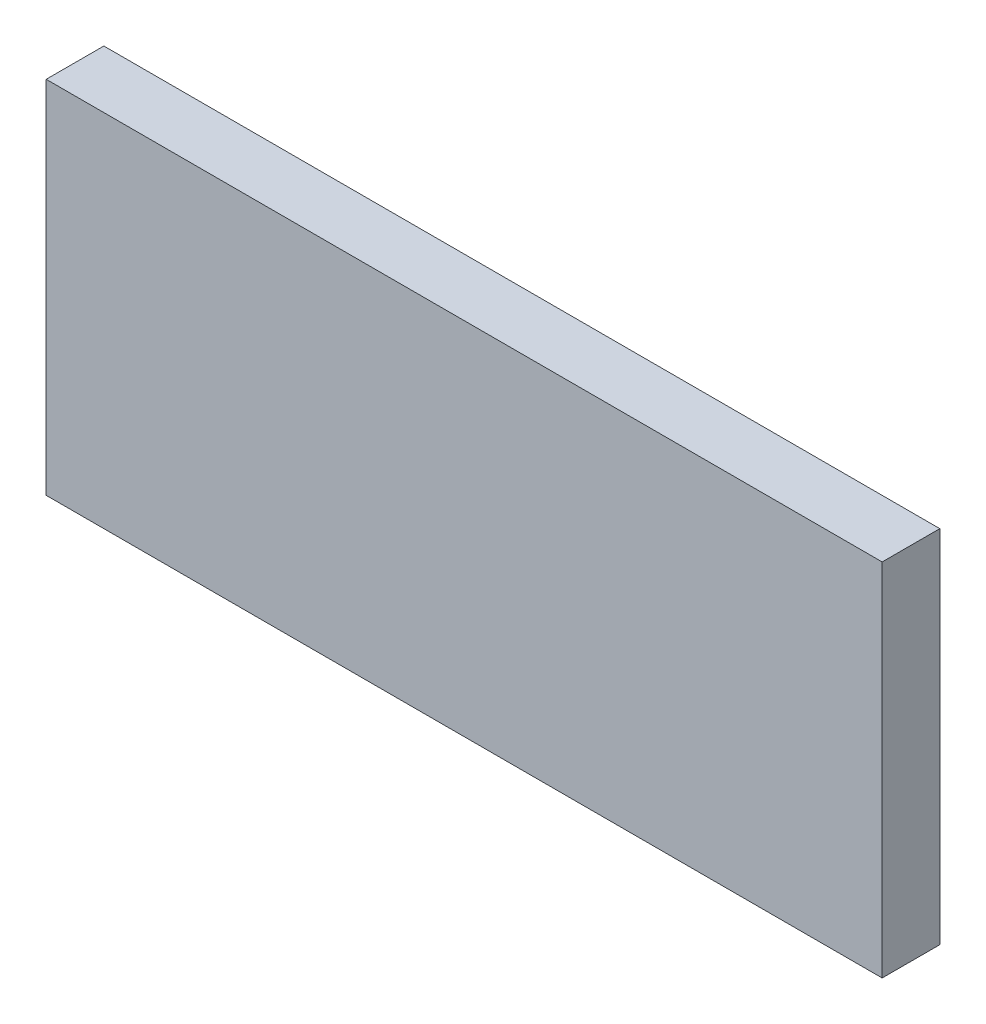
ISO-10303-21;
HEADER;
FILE_DESCRIPTION(('STEP AP214'),'2;1');
FILE_NAME('part.step','',(''),(''),'','','');
FILE_SCHEMA(('AUTOMOTIVE_DESIGN { 1 0 10303 214 1 1 1 1 }'));
ENDSEC;
DATA;
#1=APPLICATION_CONTEXT('core data for automotive mechanical design processes');
#2=APPLICATION_PROTOCOL_DEFINITION('international standard','automotive_design',2000,#1);
#3=PRODUCT_CONTEXT('',#1,'mechanical');
#4=PRODUCT('Part','Part','',(#3));
#5=PRODUCT_RELATED_PRODUCT_CATEGORY('part','',(#4));
#6=PRODUCT_DEFINITION_FORMATION('','',#4);
#7=PRODUCT_DEFINITION_CONTEXT('part definition',#1,'design');
#8=PRODUCT_DEFINITION('design','',#6,#7);
#9=PRODUCT_DEFINITION_SHAPE('','',#8);
#10=(LENGTH_UNIT() NAMED_UNIT(*) SI_UNIT(.MILLI.,.METRE.));
#11=(NAMED_UNIT(*) PLANE_ANGLE_UNIT() SI_UNIT($,.RADIAN.));
#12=(NAMED_UNIT(*) SI_UNIT($,.STERADIAN.) SOLID_ANGLE_UNIT());
#13=UNCERTAINTY_MEASURE_WITH_UNIT(LENGTH_MEASURE(1.E-05),#10,'distance_accuracy_value','');
#14=(GEOMETRIC_REPRESENTATION_CONTEXT(3) GLOBAL_UNCERTAINTY_ASSIGNED_CONTEXT((#13)) GLOBAL_UNIT_ASSIGNED_CONTEXT((#10,
#11,#12)) REPRESENTATION_CONTEXT('',''));
#15=CARTESIAN_POINT('',(0.,0.,0.));
#16=DIRECTION('',(0.,0.,1.));
#17=DIRECTION('',(1.,0.,0.));
#18=AXIS2_PLACEMENT_3D('',#15,#16,#17);
#19=CARTESIAN_POINT('',(-29.,-12.5,4.));
#20=DIRECTION('',(1.,0.,0.));
#21=DIRECTION('',(0.,0.,-1.));
#22=AXIS2_PLACEMENT_3D('',#19,#20,#21);
#23=PLANE('',#22);
#24=DIRECTION('',(0.,-1.,0.));
#25=VECTOR('',#24,1.);
#26=CARTESIAN_POINT('',(-29.,-12.5,0.));
#27=LINE('',#26,#25);
#28=CARTESIAN_POINT('',(-29.,12.5,0.));
#29=VERTEX_POINT('',#28);
#30=CARTESIAN_POINT('',(-29.,-12.5,0.));
#31=VERTEX_POINT('',#30);
#32=EDGE_CURVE('E107',#29,#31,#27,.T.);
#33=ORIENTED_EDGE('',*,*,#32,.T.);
#34=DIRECTION('',(0.,0.,-1.));
#35=VECTOR('',#34,1.);
#36=CARTESIAN_POINT('',(-29.,-12.5,4.));
#37=LINE('',#36,#35);
#38=CARTESIAN_POINT('',(-29.,-12.5,4.));
#39=VERTEX_POINT('',#38);
#40=EDGE_CURVE('E11',#39,#31,#37,.T.);
#41=ORIENTED_EDGE('',*,*,#40,.F.);
#42=DIRECTION('',(0.,-1.,0.));
#43=VECTOR('',#42,1.);
#44=CARTESIAN_POINT('',(-29.,-12.5,4.));
#45=LINE('',#44,#43);
#46=CARTESIAN_POINT('',(-29.,12.5,4.));
#47=VERTEX_POINT('',#46);
#48=EDGE_CURVE('E91',#47,#39,#45,.T.);
#49=ORIENTED_EDGE('',*,*,#48,.F.);
#50=DIRECTION('',(0.,0.,-1.));
#51=VECTOR('',#50,1.);
#52=CARTESIAN_POINT('',(-29.,12.5,4.));
#53=LINE('',#52,#51);
#54=EDGE_CURVE('E103',#47,#29,#53,.T.);
#55=ORIENTED_EDGE('',*,*,#54,.T.);
#56=EDGE_LOOP('',(#33,#41,#49,#55));
#57=FACE_BOUND('',#56,.T.);
#58=ADVANCED_FACE('F39',(#57),#23,.F.);
#59=CARTESIAN_POINT('',(29.,-12.5,4.));
#60=DIRECTION('',(0.,1.,0.));
#61=DIRECTION('',(-1.,0.,0.));
#62=AXIS2_PLACEMENT_3D('',#59,#60,#61);
#63=PLANE('',#62);
#64=DIRECTION('',(1.,0.,0.));
#65=VECTOR('',#64,1.);
#66=CARTESIAN_POINT('',(29.,-12.5,0.));
#67=LINE('',#66,#65);
#68=CARTESIAN_POINT('',(29.,-12.5,0.));
#69=VERTEX_POINT('',#68);
#70=EDGE_CURVE('E96',#31,#69,#67,.T.);
#71=ORIENTED_EDGE('',*,*,#70,.T.);
#72=DIRECTION('',(0.,0.,-1.));
#73=VECTOR('',#72,1.);
#74=CARTESIAN_POINT('',(29.,-12.5,4.));
#75=LINE('',#74,#73);
#76=CARTESIAN_POINT('',(29.,-12.5,4.));
#77=VERTEX_POINT('',#76);
#78=EDGE_CURVE('E48',#77,#69,#75,.T.);
#79=ORIENTED_EDGE('',*,*,#78,.F.);
#80=DIRECTION('',(1.,0.,0.));
#81=VECTOR('',#80,1.);
#82=CARTESIAN_POINT('',(29.,-12.5,4.));
#83=LINE('',#82,#81);
#84=EDGE_CURVE('E86',#39,#77,#83,.T.);
#85=ORIENTED_EDGE('',*,*,#84,.F.);
#86=ORIENTED_EDGE('',*,*,#40,.T.);
#87=EDGE_LOOP('',(#71,#79,#85,#86));
#88=FACE_BOUND('',#87,.T.);
#89=ADVANCED_FACE('F95',(#88),#63,.F.);
#90=CARTESIAN_POINT('',(29.,-12.5,4.));
#91=DIRECTION('',(-1.,0.,0.));
#92=DIRECTION('',(0.,0.,1.));
#93=AXIS2_PLACEMENT_3D('',#90,#91,#92);
#94=PLANE('',#93);
#95=DIRECTION('',(0.,1.,0.));
#96=VECTOR('',#95,1.);
#97=CARTESIAN_POINT('',(29.,-12.5,0.));
#98=LINE('',#97,#96);
#99=CARTESIAN_POINT('',(29.,12.5,0.));
#100=VERTEX_POINT('',#99);
#101=EDGE_CURVE('E73',#69,#100,#98,.T.);
#102=ORIENTED_EDGE('',*,*,#101,.T.);
#103=DIRECTION('',(0.,0.,-1.));
#104=VECTOR('',#103,1.);
#105=CARTESIAN_POINT('',(29.,12.5,4.));
#106=LINE('',#105,#104);
#107=CARTESIAN_POINT('',(29.,12.5,4.));
#108=VERTEX_POINT('',#107);
#109=EDGE_CURVE('E98',#108,#100,#106,.T.);
#110=ORIENTED_EDGE('',*,*,#109,.F.);
#111=DIRECTION('',(0.,1.,0.));
#112=VECTOR('',#111,1.);
#113=CARTESIAN_POINT('',(29.,-12.5,4.));
#114=LINE('',#113,#112);
#115=EDGE_CURVE('E89',#77,#108,#114,.T.);
#116=ORIENTED_EDGE('',*,*,#115,.F.);
#117=ORIENTED_EDGE('',*,*,#78,.T.);
#118=EDGE_LOOP('',(#102,#110,#116,#117));
#119=FACE_BOUND('',#118,.T.);
#120=ADVANCED_FACE('F99',(#119),#94,.F.);
#121=CARTESIAN_POINT('',(29.,12.5,4.));
#122=DIRECTION('',(0.,-1.,0.));
#123=DIRECTION('',(1.,0.,0.));
#124=AXIS2_PLACEMENT_3D('',#121,#122,#123);
#125=PLANE('',#124);
#126=DIRECTION('',(-1.,0.,0.));
#127=VECTOR('',#126,1.);
#128=CARTESIAN_POINT('',(29.,12.5,0.));
#129=LINE('',#128,#127);
#130=EDGE_CURVE('E79',#100,#29,#129,.T.);
#131=ORIENTED_EDGE('',*,*,#130,.T.);
#132=ORIENTED_EDGE('',*,*,#54,.F.);
#133=DIRECTION('',(-1.,0.,0.));
#134=VECTOR('',#133,1.);
#135=CARTESIAN_POINT('',(29.,12.5,4.));
#136=LINE('',#135,#134);
#137=EDGE_CURVE('E56',#108,#47,#136,.T.);
#138=ORIENTED_EDGE('',*,*,#137,.F.);
#139=ORIENTED_EDGE('',*,*,#109,.T.);
#140=EDGE_LOOP('',(#131,#132,#138,#139));
#141=FACE_BOUND('',#140,.T.);
#142=ADVANCED_FACE('F120',(#141),#125,.F.);
#143=CARTESIAN_POINT('',(0.,0.,4.));
#144=DIRECTION('',(0.,0.,1.));
#145=DIRECTION('',(1.,0.,0.));
#146=AXIS2_PLACEMENT_3D('',#143,#144,#145);
#147=PLANE('',#146);
#148=ORIENTED_EDGE('',*,*,#48,.T.);
#149=ORIENTED_EDGE('',*,*,#84,.T.);
#150=ORIENTED_EDGE('',*,*,#115,.T.);
#151=ORIENTED_EDGE('',*,*,#137,.T.);
#152=EDGE_LOOP('',(#148,#149,#150,#151));
#153=FACE_BOUND('',#152,.T.);
#154=ADVANCED_FACE('F87',(#153),#147,.T.);
#155=CARTESIAN_POINT('',(0.,0.,0.));
#156=DIRECTION('',(0.,0.,1.));
#157=DIRECTION('',(1.,0.,0.));
#158=AXIS2_PLACEMENT_3D('',#155,#156,#157);
#159=PLANE('',#158);
#160=ORIENTED_EDGE('',*,*,#32,.F.);
#161=ORIENTED_EDGE('',*,*,#130,.F.);
#162=ORIENTED_EDGE('',*,*,#101,.F.);
#163=ORIENTED_EDGE('',*,*,#70,.F.);
#164=EDGE_LOOP('',(#160,#161,#162,#163));
#165=FACE_BOUND('',#164,.T.);
#166=ADVANCED_FACE('F123',(#165),#159,.F.);
#167=CLOSED_SHELL('',(#58,#89,#120,#142,#154,#166));
#168=MANIFOLD_SOLID_BREP('B2',#167);
#169=ADVANCED_BREP_SHAPE_REPRESENTATION('',(#18,#168),#14);
#170=SHAPE_DEFINITION_REPRESENTATION(#9,#169);
ENDSEC;
END-ISO-10303-21;
